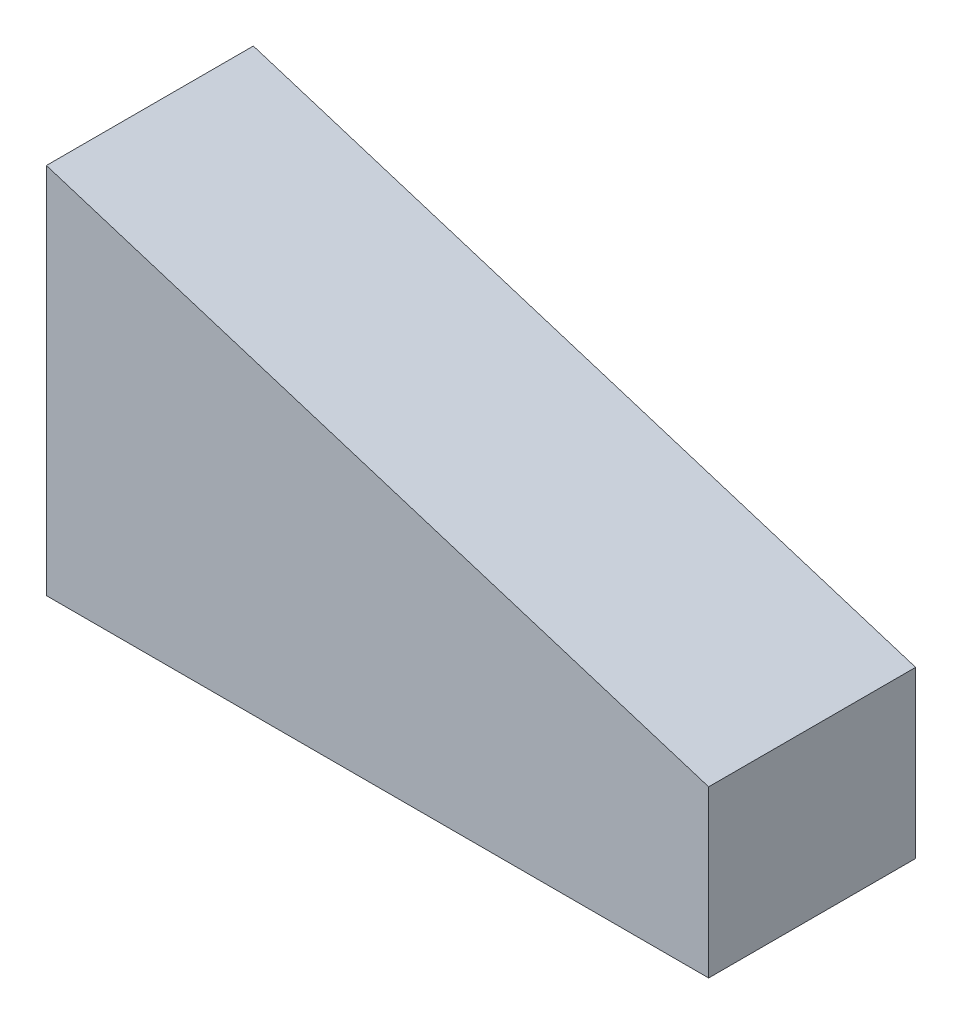
ISO-10303-21;
HEADER;
FILE_DESCRIPTION(('STEP AP214'),'2;1');
FILE_NAME('part.step','',(''),(''),'','','');
FILE_SCHEMA(('AUTOMOTIVE_DESIGN { 1 0 10303 214 1 1 1 1 }'));
ENDSEC;
DATA;
#1=APPLICATION_CONTEXT('core data for automotive mechanical design processes');
#2=APPLICATION_PROTOCOL_DEFINITION('international standard','automotive_design',2000,#1);
#3=PRODUCT_CONTEXT('',#1,'mechanical');
#4=PRODUCT('Part','Part','',(#3));
#5=PRODUCT_RELATED_PRODUCT_CATEGORY('part','',(#4));
#6=PRODUCT_DEFINITION_FORMATION('','',#4);
#7=PRODUCT_DEFINITION_CONTEXT('part definition',#1,'design');
#8=PRODUCT_DEFINITION('design','',#6,#7);
#9=PRODUCT_DEFINITION_SHAPE('','',#8);
#10=(LENGTH_UNIT() NAMED_UNIT(*) SI_UNIT(.MILLI.,.METRE.));
#11=(NAMED_UNIT(*) PLANE_ANGLE_UNIT() SI_UNIT($,.RADIAN.));
#12=(NAMED_UNIT(*) SI_UNIT($,.STERADIAN.) SOLID_ANGLE_UNIT());
#13=UNCERTAINTY_MEASURE_WITH_UNIT(LENGTH_MEASURE(1.E-05),#10,'distance_accuracy_value','');
#14=(GEOMETRIC_REPRESENTATION_CONTEXT(3) GLOBAL_UNCERTAINTY_ASSIGNED_CONTEXT((#13)) GLOBAL_UNIT_ASSIGNED_CONTEXT((#10,
#11,#12)) REPRESENTATION_CONTEXT('',''));
#15=CARTESIAN_POINT('',(0.,0.,0.));
#16=DIRECTION('',(0.,0.,1.));
#17=DIRECTION('',(1.,0.,0.));
#18=AXIS2_PLACEMENT_3D('',#15,#16,#17);
#19=CARTESIAN_POINT('',(0.,45.,25.));
#20=DIRECTION('',(1.,0.,0.));
#21=DIRECTION('',(0.,0.,-1.));
#22=AXIS2_PLACEMENT_3D('',#19,#20,#21);
#23=PLANE('',#22);
#24=DIRECTION('',(0.,-1.,0.));
#25=VECTOR('',#24,1.);
#26=CARTESIAN_POINT('',(0.,45.,0.));
#27=LINE('',#26,#25);
#28=CARTESIAN_POINT('',(0.,45.,0.));
#29=VERTEX_POINT('',#28);
#30=CARTESIAN_POINT('',(0.,0.,0.));
#31=VERTEX_POINT('',#30);
#32=EDGE_CURVE('E98',#29,#31,#27,.T.);
#33=ORIENTED_EDGE('',*,*,#32,.T.);
#34=DIRECTION('',(0.,0.,-1.));
#35=VECTOR('',#34,1.);
#36=CARTESIAN_POINT('',(0.,0.,25.));
#37=LINE('',#36,#35);
#38=CARTESIAN_POINT('',(0.,0.,25.));
#39=VERTEX_POINT('',#38);
#40=EDGE_CURVE('E11',#39,#31,#37,.T.);
#41=ORIENTED_EDGE('',*,*,#40,.F.);
#42=DIRECTION('',(0.,-1.,0.));
#43=VECTOR('',#42,1.);
#44=CARTESIAN_POINT('',(0.,45.,25.));
#45=LINE('',#44,#43);
#46=CARTESIAN_POINT('',(0.,45.,25.));
#47=VERTEX_POINT('',#46);
#48=EDGE_CURVE('E86',#47,#39,#45,.T.);
#49=ORIENTED_EDGE('',*,*,#48,.F.);
#50=DIRECTION('',(0.,0.,-1.));
#51=VECTOR('',#50,1.);
#52=CARTESIAN_POINT('',(0.,45.,25.));
#53=LINE('',#52,#51);
#54=EDGE_CURVE('E94',#47,#29,#53,.T.);
#55=ORIENTED_EDGE('',*,*,#54,.T.);
#56=EDGE_LOOP('',(#33,#41,#49,#55));
#57=FACE_BOUND('',#56,.T.);
#58=ADVANCED_FACE('F35',(#57),#23,.F.);
#59=CARTESIAN_POINT('',(0.,0.,25.));
#60=DIRECTION('',(0.,1.,0.));
#61=DIRECTION('',(0.,0.,1.));
#62=AXIS2_PLACEMENT_3D('',#59,#60,#61);
#63=PLANE('',#62);
#64=DIRECTION('',(1.,0.,0.));
#65=VECTOR('',#64,1.);
#66=CARTESIAN_POINT('',(0.,0.,0.));
#67=LINE('',#66,#65);
#68=CARTESIAN_POINT('',(80.,0.,0.));
#69=VERTEX_POINT('',#68);
#70=EDGE_CURVE('E90',#31,#69,#67,.T.);
#71=ORIENTED_EDGE('',*,*,#70,.T.);
#72=DIRECTION('',(0.,0.,-1.));
#73=VECTOR('',#72,1.);
#74=CARTESIAN_POINT('',(80.,0.,25.));
#75=LINE('',#74,#73);
#76=CARTESIAN_POINT('',(80.,0.,25.));
#77=VERTEX_POINT('',#76);
#78=EDGE_CURVE('E43',#77,#69,#75,.T.);
#79=ORIENTED_EDGE('',*,*,#78,.F.);
#80=DIRECTION('',(1.,0.,0.));
#81=VECTOR('',#80,1.);
#82=CARTESIAN_POINT('',(0.,0.,25.));
#83=LINE('',#82,#81);
#84=EDGE_CURVE('E81',#39,#77,#83,.T.);
#85=ORIENTED_EDGE('',*,*,#84,.F.);
#86=ORIENTED_EDGE('',*,*,#40,.T.);
#87=EDGE_LOOP('',(#71,#79,#85,#86));
#88=FACE_BOUND('',#87,.T.);
#89=ADVANCED_FACE('F89',(#88),#63,.F.);
#90=CARTESIAN_POINT('',(80.,0.,25.));
#91=DIRECTION('',(-1.,0.,0.));
#92=DIRECTION('',(0.,0.,1.));
#93=AXIS2_PLACEMENT_3D('',#90,#91,#92);
#94=PLANE('',#93);
#95=DIRECTION('',(0.,1.,0.));
#96=VECTOR('',#95,1.);
#97=CARTESIAN_POINT('',(80.,0.,0.));
#98=LINE('',#97,#96);
#99=CARTESIAN_POINT('',(80.,20.,0.));
#100=VERTEX_POINT('',#99);
#101=EDGE_CURVE('E68',#69,#100,#98,.T.);
#102=ORIENTED_EDGE('',*,*,#101,.T.);
#103=DIRECTION('',(0.,0.,-1.));
#104=VECTOR('',#103,1.);
#105=CARTESIAN_POINT('',(80.,20.,25.));
#106=LINE('',#105,#104);
#107=CARTESIAN_POINT('',(80.,20.,25.));
#108=VERTEX_POINT('',#107);
#109=EDGE_CURVE('E91',#108,#100,#106,.T.);
#110=ORIENTED_EDGE('',*,*,#109,.F.);
#111=DIRECTION('',(0.,1.,0.));
#112=VECTOR('',#111,1.);
#113=CARTESIAN_POINT('',(80.,0.,25.));
#114=LINE('',#113,#112);
#115=EDGE_CURVE('E84',#77,#108,#114,.T.);
#116=ORIENTED_EDGE('',*,*,#115,.F.);
#117=ORIENTED_EDGE('',*,*,#78,.T.);
#118=EDGE_LOOP('',(#102,#110,#116,#117));
#119=FACE_BOUND('',#118,.T.);
#120=ADVANCED_FACE('F92',(#119),#94,.F.);
#121=CARTESIAN_POINT('',(80.,20.,25.));
#122=DIRECTION('',(-0.298274993135947,-0.95447997803503,0.));
#123=DIRECTION('',(0.95447997803503,-0.298274993135947,0.));
#124=AXIS2_PLACEMENT_3D('',#121,#122,#123);
#125=PLANE('',#124);
#126=DIRECTION('',(-0.95447997803503,0.298274993135947,0.));
#127=VECTOR('',#126,1.);
#128=CARTESIAN_POINT('',(80.,20.,0.));
#129=LINE('',#128,#127);
#130=EDGE_CURVE('E74',#100,#29,#129,.T.);
#131=ORIENTED_EDGE('',*,*,#130,.T.);
#132=ORIENTED_EDGE('',*,*,#54,.F.);
#133=DIRECTION('',(-0.95447997803503,0.298274993135947,0.));
#134=VECTOR('',#133,1.);
#135=CARTESIAN_POINT('',(80.,20.,25.));
#136=LINE('',#135,#134);
#137=EDGE_CURVE('E51',#108,#47,#136,.T.);
#138=ORIENTED_EDGE('',*,*,#137,.F.);
#139=ORIENTED_EDGE('',*,*,#109,.T.);
#140=EDGE_LOOP('',(#131,#132,#138,#139));
#141=FACE_BOUND('',#140,.T.);
#142=ADVANCED_FACE('F105',(#141),#125,.F.);
#143=CARTESIAN_POINT('',(0.,0.,25.));
#144=DIRECTION('',(0.,0.,1.));
#145=DIRECTION('',(1.,0.,0.));
#146=AXIS2_PLACEMENT_3D('',#143,#144,#145);
#147=PLANE('',#146);
#148=ORIENTED_EDGE('',*,*,#48,.T.);
#149=ORIENTED_EDGE('',*,*,#84,.T.);
#150=ORIENTED_EDGE('',*,*,#115,.T.);
#151=ORIENTED_EDGE('',*,*,#137,.T.);
#152=EDGE_LOOP('',(#148,#149,#150,#151));
#153=FACE_BOUND('',#152,.T.);
#154=ADVANCED_FACE('F82',(#153),#147,.T.);
#155=CARTESIAN_POINT('',(0.,0.,0.));
#156=DIRECTION('',(0.,0.,1.));
#157=DIRECTION('',(1.,0.,0.));
#158=AXIS2_PLACEMENT_3D('',#155,#156,#157);
#159=PLANE('',#158);
#160=ORIENTED_EDGE('',*,*,#32,.F.);
#161=ORIENTED_EDGE('',*,*,#130,.F.);
#162=ORIENTED_EDGE('',*,*,#101,.F.);
#163=ORIENTED_EDGE('',*,*,#70,.F.);
#164=EDGE_LOOP('',(#160,#161,#162,#163));
#165=FACE_BOUND('',#164,.T.);
#166=ADVANCED_FACE('F108',(#165),#159,.F.);
#167=CLOSED_SHELL('',(#58,#89,#120,#142,#154,#166));
#168=MANIFOLD_SOLID_BREP('B2',#167);
#169=ADVANCED_BREP_SHAPE_REPRESENTATION('',(#18,#168),#14);
#170=SHAPE_DEFINITION_REPRESENTATION(#9,#169);
ENDSEC;
END-ISO-10303-21;
